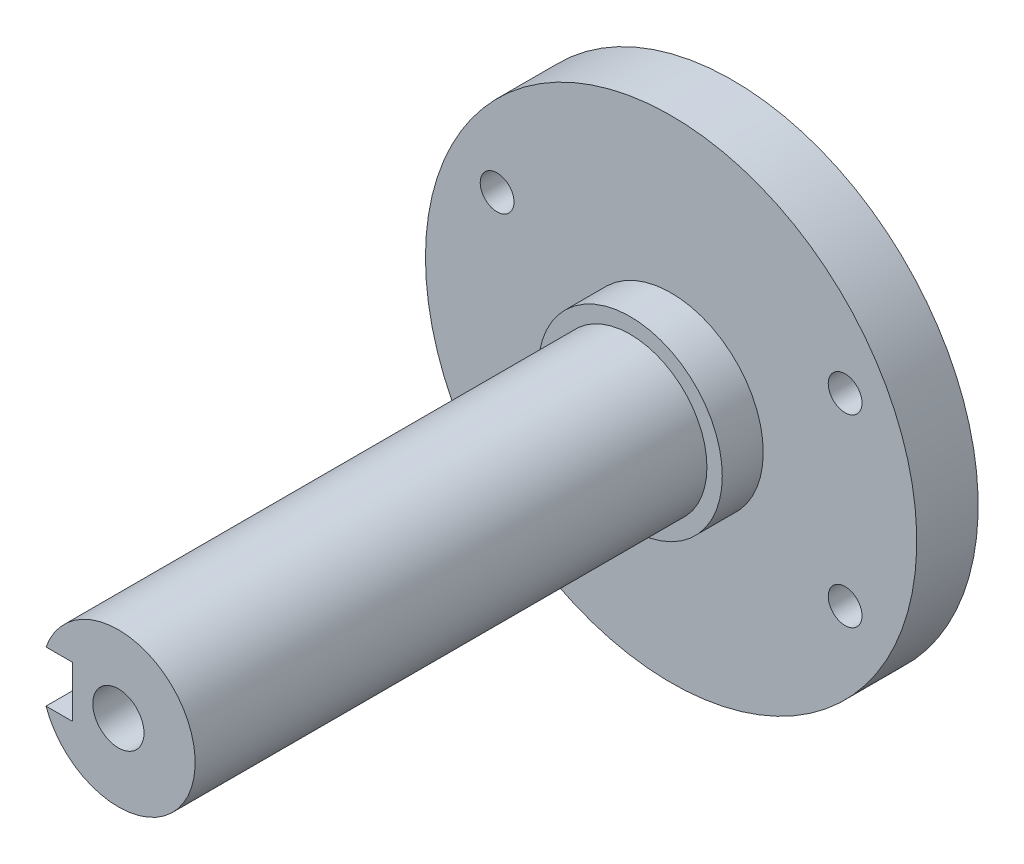
ISO-10303-21;
HEADER;
FILE_DESCRIPTION(('STEP AP214'),'2;1');
FILE_NAME('part.step','',(''),(''),'','','');
FILE_SCHEMA(('AUTOMOTIVE_DESIGN { 1 0 10303 214 1 1 1 1 }'));
ENDSEC;
DATA;
#1=APPLICATION_CONTEXT('core data for automotive mechanical design processes');
#2=APPLICATION_PROTOCOL_DEFINITION('international standard','automotive_design',2000,#1);
#3=PRODUCT_CONTEXT('',#1,'mechanical');
#4=PRODUCT('Part','Part','',(#3));
#5=PRODUCT_RELATED_PRODUCT_CATEGORY('part','',(#4));
#6=PRODUCT_DEFINITION_FORMATION('','',#4);
#7=PRODUCT_DEFINITION_CONTEXT('part definition',#1,'design');
#8=PRODUCT_DEFINITION('design','',#6,#7);
#9=PRODUCT_DEFINITION_SHAPE('','',#8);
#10=(LENGTH_UNIT() NAMED_UNIT(*) SI_UNIT(.MILLI.,.METRE.));
#11=(NAMED_UNIT(*) PLANE_ANGLE_UNIT() SI_UNIT($,.RADIAN.));
#12=(NAMED_UNIT(*) SI_UNIT($,.STERADIAN.) SOLID_ANGLE_UNIT());
#13=UNCERTAINTY_MEASURE_WITH_UNIT(LENGTH_MEASURE(1.E-05),#10,'distance_accuracy_value','');
#14=(GEOMETRIC_REPRESENTATION_CONTEXT(3) GLOBAL_UNCERTAINTY_ASSIGNED_CONTEXT((#13)) GLOBAL_UNIT_ASSIGNED_CONTEXT((#10,
#11,#12)) REPRESENTATION_CONTEXT('',''));
#15=CARTESIAN_POINT('',(0.,0.,0.));
#16=DIRECTION('',(0.,0.,1.));
#17=DIRECTION('',(1.,0.,0.));
#18=AXIS2_PLACEMENT_3D('',#15,#16,#17);
#19=CARTESIAN_POINT('',(0.,0.,4.));
#20=DIRECTION('',(0.,0.,-1.));
#21=DIRECTION('',(-1.,0.,0.));
#22=AXIS2_PLACEMENT_3D('',#19,#20,#21);
#23=CYLINDRICAL_SURFACE('',#22,9.);
#24=CARTESIAN_POINT('',(0.,0.,4.));
#25=DIRECTION('',(0.,0.,1.));
#26=DIRECTION('',(1.,0.,0.));
#27=AXIS2_PLACEMENT_3D('',#24,#25,#26);
#28=CIRCLE('',#27,9.);
#29=CARTESIAN_POINT('',(9.,0.,4.));
#30=VERTEX_POINT('',#29);
#31=EDGE_CURVE('E144',#30,#30,#28,.T.);
#32=ORIENTED_EDGE('',*,*,#31,.F.);
#33=EDGE_LOOP('',(#32));
#34=FACE_BOUND('',#33,.T.);
#35=CARTESIAN_POINT('',(0.,0.,0.));
#36=DIRECTION('',(0.,0.,1.));
#37=DIRECTION('',(1.,0.,0.));
#38=AXIS2_PLACEMENT_3D('',#35,#36,#37);
#39=CIRCLE('',#38,9.);
#40=CARTESIAN_POINT('',(9.,0.,0.));
#41=VERTEX_POINT('',#40);
#42=EDGE_CURVE('E148',#41,#41,#39,.T.);
#43=ORIENTED_EDGE('',*,*,#42,.T.);
#44=EDGE_LOOP('',(#43));
#45=FACE_BOUND('',#44,.T.);
#46=ADVANCED_FACE('F34',(#34,#45),#23,.T.);
#47=CARTESIAN_POINT('',(0.,0.,4.));
#48=DIRECTION('',(0.,0.,1.));
#49=DIRECTION('',(1.,0.,0.));
#50=AXIS2_PLACEMENT_3D('',#47,#48,#49);
#51=PLANE('',#50);
#52=CARTESIAN_POINT('',(0.,0.,4.));
#53=DIRECTION('',(0.,0.,1.));
#54=DIRECTION('',(1.,0.,0.));
#55=AXIS2_PLACEMENT_3D('',#52,#53,#54);
#56=CIRCLE('',#55,7.5);
#57=CARTESIAN_POINT('',(7.5,0.,4.));
#58=VERTEX_POINT('',#57);
#59=EDGE_CURVE('E140',#58,#58,#56,.T.);
#60=ORIENTED_EDGE('',*,*,#59,.F.);
#61=EDGE_LOOP('',(#60));
#62=FACE_BOUND('',#61,.T.);
#63=ORIENTED_EDGE('',*,*,#31,.T.);
#64=EDGE_LOOP('',(#63));
#65=FACE_BOUND('',#64,.T.);
#66=ADVANCED_FACE('F177',(#62,#65),#51,.T.);
#67=CARTESIAN_POINT('',(0.,0.,-6.));
#68=DIRECTION('',(0.,0.,1.));
#69=DIRECTION('',(1.,0.,0.));
#70=AXIS2_PLACEMENT_3D('',#67,#68,#69);
#71=CYLINDRICAL_SURFACE('',#70,24.);
#72=CARTESIAN_POINT('',(0.,0.,-6.));
#73=DIRECTION('',(0.,0.,-1.));
#74=DIRECTION('',(-1.,0.,0.));
#75=AXIS2_PLACEMENT_3D('',#72,#73,#74);
#76=CIRCLE('',#75,24.);
#77=CARTESIAN_POINT('',(-24.,0.,-6.));
#78=VERTEX_POINT('',#77);
#79=EDGE_CURVE('E145',#78,#78,#76,.T.);
#80=ORIENTED_EDGE('',*,*,#79,.F.);
#81=EDGE_LOOP('',(#80));
#82=FACE_BOUND('',#81,.T.);
#83=CARTESIAN_POINT('',(0.,0.,0.));
#84=DIRECTION('',(0.,0.,-1.));
#85=DIRECTION('',(-1.,0.,0.));
#86=AXIS2_PLACEMENT_3D('',#83,#84,#85);
#87=CIRCLE('',#86,24.);
#88=CARTESIAN_POINT('',(-24.,0.,0.));
#89=VERTEX_POINT('',#88);
#90=EDGE_CURVE('E139',#89,#89,#87,.T.);
#91=ORIENTED_EDGE('',*,*,#90,.T.);
#92=EDGE_LOOP('',(#91));
#93=FACE_BOUND('',#92,.T.);
#94=ADVANCED_FACE('F180',(#82,#93),#71,.T.);
#95=CARTESIAN_POINT('',(0.,0.,-6.));
#96=DIRECTION('',(0.,0.,-1.));
#97=DIRECTION('',(-1.,0.,0.));
#98=AXIS2_PLACEMENT_3D('',#95,#96,#97);
#99=PLANE('',#98);
#100=CARTESIAN_POINT('',(17.,8.99999999999999,-6.));
#101=DIRECTION('',(0.,0.,-1.));
#102=DIRECTION('',(-1.,0.,0.));
#103=AXIS2_PLACEMENT_3D('',#100,#101,#102);
#104=CIRCLE('',#103,1.65);
#105=CARTESIAN_POINT('',(15.35,8.99999999999999,-6.));
#106=VERTEX_POINT('',#105);
#107=EDGE_CURVE('E112',#106,#106,#104,.T.);
#108=ORIENTED_EDGE('',*,*,#107,.F.);
#109=EDGE_LOOP('',(#108));
#110=FACE_BOUND('',#109,.T.);
#111=CARTESIAN_POINT('',(-17.,-9.,-6.));
#112=DIRECTION('',(0.,0.,-1.));
#113=DIRECTION('',(-1.,0.,0.));
#114=AXIS2_PLACEMENT_3D('',#111,#112,#113);
#115=CIRCLE('',#114,1.65);
#116=CARTESIAN_POINT('',(-18.65,-9.,-6.));
#117=VERTEX_POINT('',#116);
#118=EDGE_CURVE('E118',#117,#117,#115,.T.);
#119=ORIENTED_EDGE('',*,*,#118,.F.);
#120=EDGE_LOOP('',(#119));
#121=FACE_BOUND('',#120,.T.);
#122=CARTESIAN_POINT('',(-17.,9.,-6.));
#123=DIRECTION('',(0.,0.,-1.));
#124=DIRECTION('',(-1.,0.,0.));
#125=AXIS2_PLACEMENT_3D('',#122,#123,#124);
#126=CIRCLE('',#125,1.65);
#127=CARTESIAN_POINT('',(-18.65,9.,-6.));
#128=VERTEX_POINT('',#127);
#129=EDGE_CURVE('E124',#128,#128,#126,.T.);
#130=ORIENTED_EDGE('',*,*,#129,.F.);
#131=EDGE_LOOP('',(#130));
#132=FACE_BOUND('',#131,.T.);
#133=CARTESIAN_POINT('',(17.,-9.00000000000001,-6.));
#134=DIRECTION('',(0.,0.,-1.));
#135=DIRECTION('',(-1.,0.,0.));
#136=AXIS2_PLACEMENT_3D('',#133,#134,#135);
#137=CIRCLE('',#136,1.65);
#138=CARTESIAN_POINT('',(15.35,-9.00000000000001,-6.));
#139=VERTEX_POINT('',#138);
#140=EDGE_CURVE('E130',#139,#139,#137,.T.);
#141=ORIENTED_EDGE('',*,*,#140,.F.);
#142=EDGE_LOOP('',(#141));
#143=FACE_BOUND('',#142,.T.);
#144=ORIENTED_EDGE('',*,*,#79,.T.);
#145=EDGE_LOOP('',(#144));
#146=FACE_BOUND('',#145,.T.);
#147=ADVANCED_FACE('F189',(#110,#121,#132,#143,#146),#99,.T.);
#148=CARTESIAN_POINT('',(0.,0.,0.));
#149=DIRECTION('',(0.,0.,-1.));
#150=DIRECTION('',(-1.,0.,0.));
#151=AXIS2_PLACEMENT_3D('',#148,#149,#150);
#152=PLANE('',#151);
#153=CARTESIAN_POINT('',(17.,8.99999999999999,0.));
#154=DIRECTION('',(0.,0.,-1.));
#155=DIRECTION('',(-1.,0.,0.));
#156=AXIS2_PLACEMENT_3D('',#153,#154,#155);
#157=CIRCLE('',#156,1.65);
#158=CARTESIAN_POINT('',(15.35,8.99999999999999,0.));
#159=VERTEX_POINT('',#158);
#160=EDGE_CURVE('E115',#159,#159,#157,.T.);
#161=ORIENTED_EDGE('',*,*,#160,.T.);
#162=EDGE_LOOP('',(#161));
#163=FACE_BOUND('',#162,.T.);
#164=CARTESIAN_POINT('',(-17.,-9.,0.));
#165=DIRECTION('',(0.,0.,-1.));
#166=DIRECTION('',(-1.,0.,0.));
#167=AXIS2_PLACEMENT_3D('',#164,#165,#166);
#168=CIRCLE('',#167,1.65);
#169=CARTESIAN_POINT('',(-18.65,-9.,0.));
#170=VERTEX_POINT('',#169);
#171=EDGE_CURVE('E121',#170,#170,#168,.T.);
#172=ORIENTED_EDGE('',*,*,#171,.T.);
#173=EDGE_LOOP('',(#172));
#174=FACE_BOUND('',#173,.T.);
#175=CARTESIAN_POINT('',(-17.,9.,0.));
#176=DIRECTION('',(0.,0.,-1.));
#177=DIRECTION('',(-1.,0.,0.));
#178=AXIS2_PLACEMENT_3D('',#175,#176,#177);
#179=CIRCLE('',#178,1.65);
#180=CARTESIAN_POINT('',(-18.65,9.,0.));
#181=VERTEX_POINT('',#180);
#182=EDGE_CURVE('E127',#181,#181,#179,.T.);
#183=ORIENTED_EDGE('',*,*,#182,.T.);
#184=EDGE_LOOP('',(#183));
#185=FACE_BOUND('',#184,.T.);
#186=CARTESIAN_POINT('',(17.,-9.00000000000001,0.));
#187=DIRECTION('',(0.,0.,-1.));
#188=DIRECTION('',(-1.,0.,0.));
#189=AXIS2_PLACEMENT_3D('',#186,#187,#188);
#190=CIRCLE('',#189,1.65);
#191=CARTESIAN_POINT('',(15.35,-9.00000000000001,0.));
#192=VERTEX_POINT('',#191);
#193=EDGE_CURVE('E133',#192,#192,#190,.T.);
#194=ORIENTED_EDGE('',*,*,#193,.T.);
#195=EDGE_LOOP('',(#194));
#196=FACE_BOUND('',#195,.T.);
#197=ORIENTED_EDGE('',*,*,#42,.F.);
#198=EDGE_LOOP('',(#197));
#199=FACE_BOUND('',#198,.T.);
#200=ORIENTED_EDGE('',*,*,#90,.F.);
#201=EDGE_LOOP('',(#200));
#202=FACE_BOUND('',#201,.T.);
#203=ADVANCED_FACE('F174',(#163,#174,#185,#196,#199,#202),#152,.F.);
#204=CARTESIAN_POINT('',(0.,0.,54.));
#205=DIRECTION('',(0.,0.,-1.));
#206=DIRECTION('',(-1.,0.,0.));
#207=AXIS2_PLACEMENT_3D('',#204,#205,#206);
#208=CYLINDRICAL_SURFACE('',#207,7.5);
#209=CARTESIAN_POINT('',(0.,0.,54.));
#210=DIRECTION('',(0.,0.,1.));
#211=DIRECTION('',(1.,0.,0.));
#212=AXIS2_PLACEMENT_3D('',#209,#210,#211);
#213=CIRCLE('',#212,7.5);
#214=CARTESIAN_POINT('',(-7.07106781186547,-2.50000000000001,54.));
#215=VERTEX_POINT('',#214);
#216=CARTESIAN_POINT('',(-7.07106781186548,2.49999999999999,54.));
#217=VERTEX_POINT('',#216);
#218=EDGE_CURVE('E136',#215,#217,#213,.T.);
#219=ORIENTED_EDGE('',*,*,#218,.F.);
#220=DIRECTION('',(0.,0.,-1.));
#221=VECTOR('',#220,1.);
#222=CARTESIAN_POINT('',(-7.07106781186547,-2.50000000000001,54.));
#223=LINE('',#222,#221);
#224=CARTESIAN_POINT('',(-7.07106781186547,-2.50000000000001,29.));
#225=VERTEX_POINT('',#224);
#226=EDGE_CURVE('E61',#215,#225,#223,.T.);
#227=ORIENTED_EDGE('',*,*,#226,.T.);
#228=CARTESIAN_POINT('',(-7.07106781186547,-2.50000000000001,29.));
#229=CARTESIAN_POINT('',(-7.07105693273157,-2.50000899110406,28.9317929221797));
#230=CARTESIAN_POINT('',(-7.07205443904569,-2.49720887221586,28.8635919253246));
#231=CARTESIAN_POINT('',(-7.07598524121007,-2.48606045780471,28.7277189616507));
#232=CARTESIAN_POINT('',(-7.07891801450642,-2.47771365997203,28.660046857012));
#233=CARTESIAN_POINT('',(-7.08662705252507,-2.45557459422796,28.5259095116455));
#234=CARTESIAN_POINT('',(-7.09139784850118,-2.44179847763136,28.4594412974491));
#235=CARTESIAN_POINT('',(-7.10262619906002,-2.40894181030121,28.3279917314172));
#236=CARTESIAN_POINT('',(-7.1090838146033,-2.38986106786033,28.2630104334101));
#237=CARTESIAN_POINT('',(-7.13069940793911,-2.32491551306197,28.0710384202854));
#238=CARTESIAN_POINT('',(-7.14811243884051,-2.27131416810251,27.94682084253));
#239=CARTESIAN_POINT('',(-7.1869703408752,-2.14517784106255,27.7091231885366));
#240=CARTESIAN_POINT('',(-7.20841768551076,-2.07263123268532,27.5956497642198));
#241=CARTESIAN_POINT('',(-7.25386182389478,-1.90762995846819,27.3782070965292));
#242=CARTESIAN_POINT('',(-7.27792189428067,-1.81456284630833,27.2747148572318));
#243=CARTESIAN_POINT('',(-7.32534626726038,-1.61247071190513,27.0844828967663));
#244=CARTESIAN_POINT('',(-7.34871044533518,-1.50344285413659,26.997746158681));
#245=CARTESIAN_POINT('',(-7.39284706096344,-1.26900922493973,26.8413017757375));
#246=CARTESIAN_POINT('',(-7.41353593532888,-1.14325025284462,26.7720976922578));
#247=CARTESIAN_POINT('',(-7.44924021883278,-0.881073095475297,26.6560192175653));
#248=CARTESIAN_POINT('',(-7.46425736081204,-0.744658181225892,26.6091380050743));
#249=CARTESIAN_POINT('',(-7.48647677762783,-0.470073371182918,26.5406607237417));
#250=CARTESIAN_POINT('',(-7.49393272446142,-0.332129588153752,26.5182418290428));
#251=CARTESIAN_POINT('',(-7.50109021034827,-0.0542474216362072,26.4967092432615));
#252=CARTESIAN_POINT('',(-7.50079359709905,0.0856904786402088,26.4975899990842));
#253=CARTESIAN_POINT('',(-7.49265096581776,0.357759612692397,26.5221107104005));
#254=CARTESIAN_POINT('',(-7.48510152476447,0.489981756428167,26.5448565956047));
#255=CARTESIAN_POINT('',(-7.46367401253772,0.748610161077306,26.6109829959792));
#256=CARTESIAN_POINT('',(-7.44979559044789,0.875016099077731,26.6543646553253));
#257=CARTESIAN_POINT('',(-7.41689170677793,1.12038155754034,26.7610534241945));
#258=CARTESIAN_POINT('',(-7.39780094595656,1.23922126412503,26.8246151128576));
#259=CARTESIAN_POINT('',(-7.35645969200236,1.46481147275366,26.969649878425));
#260=CARTESIAN_POINT('',(-7.33420833994017,1.57155867428943,27.0511278276021));
#261=CARTESIAN_POINT('',(-7.28765679856813,1.77524334927517,27.234177625007));
#262=CARTESIAN_POINT('',(-7.26330946699776,1.87148402903097,27.3365138590282));
#263=CARTESIAN_POINT('',(-7.21618726182138,2.04568006205172,27.5561037242864));
#264=CARTESIAN_POINT('',(-7.19341289789386,2.12362950795973,27.673362156007));
#265=CARTESIAN_POINT('',(-7.15175078440791,2.26000831398174,27.9217004458843));
#266=CARTESIAN_POINT('',(-7.13292537370586,2.31813252376914,28.0529587873326));
#267=CARTESIAN_POINT('',(-7.10202742655099,2.41115057675284,28.3241174439746));
#268=CARTESIAN_POINT('',(-7.08994423522482,2.44608109013839,28.4640037334303));
#269=CARTESIAN_POINT('',(-7.078413552368,2.47914539070206,28.67104659187));
#270=CARTESIAN_POINT('',(-7.07566669236505,2.48696265313778,28.7366034746356));
#271=CARTESIAN_POINT('',(-7.07199258928498,2.49738654017799,28.8680951959995));
#272=CARTESIAN_POINT('',(-7.0710629982382,2.49999988848744,28.934029436361));
#273=CARTESIAN_POINT('',(-7.07106781186548,2.49999999999999,29.));
#274=B_SPLINE_CURVE_WITH_KNOTS('',3,(#228,#229,#230,#231,#232,#233,#234,#235,#236,#237,#238,
#239,#240,#241,#242,#243,#244,#245,#246,#247,#248,#249,#250,#251,#252,#253,#254,#255,#256,#257,
#258,#259,#260,#261,#262,#263,#264,#265,#266,#267,#268,#269,#270,#271,#272,#273),.UNSPECIFIED.,
.F.,.F.,(4,2,2,2,2,2,2,2,2,2,2,2,2,2,2,2,2,2,2,2,2,2,4),(0.,0.204546211838584,0.409037215423656,
0.612924429429074,0.816819012805388,1.22401016923255,1.63145179965523,2.0532786408839,
2.47518051341064,2.90809434014449,3.34087579484513,3.75860278500203,4.17623021758301,
4.57747647846033,4.97874498952315,5.38529148746615,5.79194868153617,6.21771736826821,
6.64362337304801,7.07581676501795,7.50732520398793,7.70536340013574,7.90314555504337),.UNSPECIFIED.);
#275=CARTESIAN_POINT('',(-7.07106781186548,2.49999999999999,29.));
#276=VERTEX_POINT('',#275);
#277=EDGE_CURVE('E11',#225,#276,#274,.T.);
#278=ORIENTED_EDGE('',*,*,#277,.T.);
#279=DIRECTION('',(0.,0.,-1.));
#280=VECTOR('',#279,1.);
#281=CARTESIAN_POINT('',(-7.07106781186548,2.49999999999999,54.));
#282=LINE('',#281,#280);
#283=EDGE_CURVE('E106',#276,#217,#282,.F.);
#284=ORIENTED_EDGE('',*,*,#283,.T.);
#285=EDGE_LOOP('',(#219,#227,#278,#284));
#286=FACE_BOUND('',#285,.T.);
#287=ORIENTED_EDGE('',*,*,#59,.T.);
#288=EDGE_LOOP('',(#287));
#289=FACE_BOUND('',#288,.T.);
#290=ADVANCED_FACE('F171',(#286,#289),#208,.T.);
#291=CARTESIAN_POINT('',(0.,0.,54.));
#292=DIRECTION('',(0.,0.,1.));
#293=DIRECTION('',(1.,0.,0.));
#294=AXIS2_PLACEMENT_3D('',#291,#292,#293);
#295=PLANE('',#294);
#296=CARTESIAN_POINT('',(0.,0.,54.));
#297=DIRECTION('',(0.,0.,1.));
#298=DIRECTION('',(1.,0.,0.));
#299=AXIS2_PLACEMENT_3D('',#296,#297,#298);
#300=CIRCLE('',#299,2.5);
#301=CARTESIAN_POINT('',(2.5,0.,54.));
#302=VERTEX_POINT('',#301);
#303=EDGE_CURVE('E94',#302,#302,#300,.T.);
#304=ORIENTED_EDGE('',*,*,#303,.F.);
#305=EDGE_LOOP('',(#304));
#306=FACE_BOUND('',#305,.T.);
#307=DIRECTION('',(1.,0.,0.));
#308=VECTOR('',#307,1.);
#309=CARTESIAN_POINT('',(0.,-2.50000000000001,54.));
#310=LINE('',#309,#308);
#311=CARTESIAN_POINT('',(-4.5,-2.50000000000001,54.));
#312=VERTEX_POINT('',#311);
#313=EDGE_CURVE('E47',#215,#312,#310,.T.);
#314=ORIENTED_EDGE('',*,*,#313,.F.);
#315=ORIENTED_EDGE('',*,*,#218,.T.);
#316=DIRECTION('',(-1.,0.,0.));
#317=VECTOR('',#316,1.);
#318=CARTESIAN_POINT('',(0.,2.49999999999999,54.));
#319=LINE('',#318,#317);
#320=CARTESIAN_POINT('',(-4.5,2.49999999999999,54.));
#321=VERTEX_POINT('',#320);
#322=EDGE_CURVE('E157',#321,#217,#319,.T.);
#323=ORIENTED_EDGE('',*,*,#322,.F.);
#324=DIRECTION('',(0.,-1.,0.));
#325=VECTOR('',#324,1.);
#326=CARTESIAN_POINT('',(-4.5,0.,54.));
#327=LINE('',#326,#325);
#328=EDGE_CURVE('E143',#321,#312,#327,.T.);
#329=ORIENTED_EDGE('',*,*,#328,.T.);
#330=EDGE_LOOP('',(#314,#315,#323,#329));
#331=FACE_BOUND('',#330,.T.);
#332=ADVANCED_FACE('F162',(#306,#331),#295,.T.);
#333=CARTESIAN_POINT('',(17.,-9.00000000000001,-6.));
#334=DIRECTION('',(0.,0.,-1.));
#335=DIRECTION('',(-1.,0.,0.));
#336=AXIS2_PLACEMENT_3D('',#333,#334,#335);
#337=CYLINDRICAL_SURFACE('',#336,1.65);
#338=ORIENTED_EDGE('',*,*,#193,.F.);
#339=EDGE_LOOP('',(#338));
#340=FACE_BOUND('',#339,.T.);
#341=ORIENTED_EDGE('',*,*,#140,.T.);
#342=EDGE_LOOP('',(#341));
#343=FACE_BOUND('',#342,.T.);
#344=ADVANCED_FACE('F207',(#340,#343),#337,.F.);
#345=CARTESIAN_POINT('',(-17.,9.,-6.));
#346=DIRECTION('',(0.,0.,-1.));
#347=DIRECTION('',(-1.,0.,0.));
#348=AXIS2_PLACEMENT_3D('',#345,#346,#347);
#349=CYLINDRICAL_SURFACE('',#348,1.65);
#350=ORIENTED_EDGE('',*,*,#182,.F.);
#351=EDGE_LOOP('',(#350));
#352=FACE_BOUND('',#351,.T.);
#353=ORIENTED_EDGE('',*,*,#129,.T.);
#354=EDGE_LOOP('',(#353));
#355=FACE_BOUND('',#354,.T.);
#356=ADVANCED_FACE('F211',(#352,#355),#349,.F.);
#357=CARTESIAN_POINT('',(-17.,-9.,-6.));
#358=DIRECTION('',(0.,0.,-1.));
#359=DIRECTION('',(-1.,0.,0.));
#360=AXIS2_PLACEMENT_3D('',#357,#358,#359);
#361=CYLINDRICAL_SURFACE('',#360,1.65);
#362=ORIENTED_EDGE('',*,*,#171,.F.);
#363=EDGE_LOOP('',(#362));
#364=FACE_BOUND('',#363,.T.);
#365=ORIENTED_EDGE('',*,*,#118,.T.);
#366=EDGE_LOOP('',(#365));
#367=FACE_BOUND('',#366,.T.);
#368=ADVANCED_FACE('F215',(#364,#367),#361,.F.);
#369=CARTESIAN_POINT('',(17.,8.99999999999999,-6.));
#370=DIRECTION('',(0.,0.,-1.));
#371=DIRECTION('',(-1.,0.,0.));
#372=AXIS2_PLACEMENT_3D('',#369,#370,#371);
#373=CYLINDRICAL_SURFACE('',#372,1.65);
#374=ORIENTED_EDGE('',*,*,#160,.F.);
#375=EDGE_LOOP('',(#374));
#376=FACE_BOUND('',#375,.T.);
#377=ORIENTED_EDGE('',*,*,#107,.T.);
#378=EDGE_LOOP('',(#377));
#379=FACE_BOUND('',#378,.T.);
#380=ADVANCED_FACE('F219',(#376,#379),#373,.F.);
#381=CARTESIAN_POINT('',(-4.5,0.,29.));
#382=DIRECTION('',(-1.,0.,0.));
#383=DIRECTION('',(0.,0.,1.));
#384=AXIS2_PLACEMENT_3D('',#381,#382,#383);
#385=CYLINDRICAL_SURFACE('',#384,2.5);
#386=DIRECTION('',(-1.,0.,0.));
#387=VECTOR('',#386,1.);
#388=CARTESIAN_POINT('',(-4.5,-2.50000000000001,29.));
#389=LINE('',#388,#387);
#390=CARTESIAN_POINT('',(-4.5,-2.50000000000001,29.));
#391=VERTEX_POINT('',#390);
#392=EDGE_CURVE('E104',#391,#225,#389,.T.);
#393=ORIENTED_EDGE('',*,*,#392,.F.);
#394=CARTESIAN_POINT('',(-4.5,0.,29.));
#395=DIRECTION('',(-1.,0.,0.));
#396=DIRECTION('',(0.,0.,1.));
#397=AXIS2_PLACEMENT_3D('',#394,#395,#396);
#398=CIRCLE('',#397,2.5);
#399=CARTESIAN_POINT('',(-4.5,2.49999999999999,29.));
#400=VERTEX_POINT('',#399);
#401=EDGE_CURVE('E96',#400,#391,#398,.T.);
#402=ORIENTED_EDGE('',*,*,#401,.F.);
#403=DIRECTION('',(-1.,0.,0.));
#404=VECTOR('',#403,1.);
#405=CARTESIAN_POINT('',(-4.5,2.49999999999999,29.));
#406=LINE('',#405,#404);
#407=EDGE_CURVE('E103',#400,#276,#406,.T.);
#408=ORIENTED_EDGE('',*,*,#407,.T.);
#409=ORIENTED_EDGE('',*,*,#277,.F.);
#410=EDGE_LOOP('',(#393,#402,#408,#409));
#411=FACE_BOUND('',#410,.T.);
#412=ADVANCED_FACE('F169',(#411),#385,.F.);
#413=CARTESIAN_POINT('',(-4.5,-2.50000000000001,79.));
#414=DIRECTION('',(0.,-1.,0.));
#415=DIRECTION('',(0.,0.,-1.));
#416=AXIS2_PLACEMENT_3D('',#413,#414,#415);
#417=PLANE('',#416);
#418=ORIENTED_EDGE('',*,*,#313,.T.);
#419=DIRECTION('',(0.,0.,1.));
#420=VECTOR('',#419,1.);
#421=CARTESIAN_POINT('',(-4.5,-2.50000000000001,79.));
#422=LINE('',#421,#420);
#423=EDGE_CURVE('E54',#391,#312,#422,.T.);
#424=ORIENTED_EDGE('',*,*,#423,.F.);
#425=ORIENTED_EDGE('',*,*,#392,.T.);
#426=ORIENTED_EDGE('',*,*,#226,.F.);
#427=EDGE_LOOP('',(#418,#424,#425,#426));
#428=FACE_BOUND('',#427,.T.);
#429=ADVANCED_FACE('F158',(#428),#417,.F.);
#430=CARTESIAN_POINT('',(-4.5,2.49999999999999,79.));
#431=DIRECTION('',(0.,1.,0.));
#432=DIRECTION('',(0.,0.,1.));
#433=AXIS2_PLACEMENT_3D('',#430,#431,#432);
#434=PLANE('',#433);
#435=ORIENTED_EDGE('',*,*,#407,.F.);
#436=DIRECTION('',(0.,0.,-1.));
#437=VECTOR('',#436,1.);
#438=CARTESIAN_POINT('',(-4.5,2.49999999999999,79.));
#439=LINE('',#438,#437);
#440=EDGE_CURVE('E93',#321,#400,#439,.T.);
#441=ORIENTED_EDGE('',*,*,#440,.F.);
#442=ORIENTED_EDGE('',*,*,#322,.T.);
#443=ORIENTED_EDGE('',*,*,#283,.F.);
#444=EDGE_LOOP('',(#435,#441,#442,#443));
#445=FACE_BOUND('',#444,.T.);
#446=ADVANCED_FACE('F166',(#445),#434,.F.);
#447=CARTESIAN_POINT('',(-4.5,0.,79.));
#448=DIRECTION('',(-1.,0.,0.));
#449=DIRECTION('',(0.,0.,1.));
#450=AXIS2_PLACEMENT_3D('',#447,#448,#449);
#451=PLANE('',#450);
#452=ORIENTED_EDGE('',*,*,#440,.T.);
#453=ORIENTED_EDGE('',*,*,#401,.T.);
#454=ORIENTED_EDGE('',*,*,#423,.T.);
#455=ORIENTED_EDGE('',*,*,#328,.F.);
#456=EDGE_LOOP('',(#452,#453,#454,#455));
#457=FACE_BOUND('',#456,.T.);
#458=ADVANCED_FACE('F87',(#457),#451,.T.);
#459=CARTESIAN_POINT('',(0.,0.,39.));
#460=DIRECTION('',(0.,0.,1.));
#461=DIRECTION('',(1.,0.,0.));
#462=AXIS2_PLACEMENT_3D('',#459,#460,#461);
#463=CONICAL_SURFACE('',#462,2.5,1.02974425867665);
#464=CARTESIAN_POINT('',(0.,0.,37.4978484524311));
#465=VERTEX_POINT('',#464);
#466=VERTEX_LOOP('',#465);
#467=FACE_BOUND('',#466,.T.);
#468=CARTESIAN_POINT('',(0.,0.,39.));
#469=DIRECTION('',(0.,0.,1.));
#470=DIRECTION('',(1.,0.,0.));
#471=AXIS2_PLACEMENT_3D('',#468,#469,#470);
#472=CIRCLE('',#471,2.5);
#473=CARTESIAN_POINT('',(2.5,0.,39.));
#474=VERTEX_POINT('',#473);
#475=EDGE_CURVE('E91',#474,#474,#472,.T.);
#476=ORIENTED_EDGE('',*,*,#475,.T.);
#477=EDGE_LOOP('',(#476));
#478=FACE_BOUND('',#477,.T.);
#479=ADVANCED_FACE('F83',(#467,#478),#463,.F.);
#480=CARTESIAN_POINT('',(0.,0.,54.));
#481=DIRECTION('',(0.,0.,1.));
#482=DIRECTION('',(1.,0.,0.));
#483=AXIS2_PLACEMENT_3D('',#480,#481,#482);
#484=CYLINDRICAL_SURFACE('',#483,2.5);
#485=ORIENTED_EDGE('',*,*,#475,.F.);
#486=EDGE_LOOP('',(#485));
#487=FACE_BOUND('',#486,.T.);
#488=ORIENTED_EDGE('',*,*,#303,.T.);
#489=EDGE_LOOP('',(#488));
#490=FACE_BOUND('',#489,.T.);
#491=ADVANCED_FACE('F86',(#487,#490),#484,.F.);
#492=CLOSED_SHELL('',(#46,#66,#94,#147,#203,#290,#332,#344,#356,#368,#380,#412,#429,#446,#458,
#479,#491));
#493=MANIFOLD_SOLID_BREP('B2',#492);
#494=ADVANCED_BREP_SHAPE_REPRESENTATION('',(#18,#493),#14);
#495=SHAPE_DEFINITION_REPRESENTATION(#9,#494);
ENDSEC;
END-ISO-10303-21;
